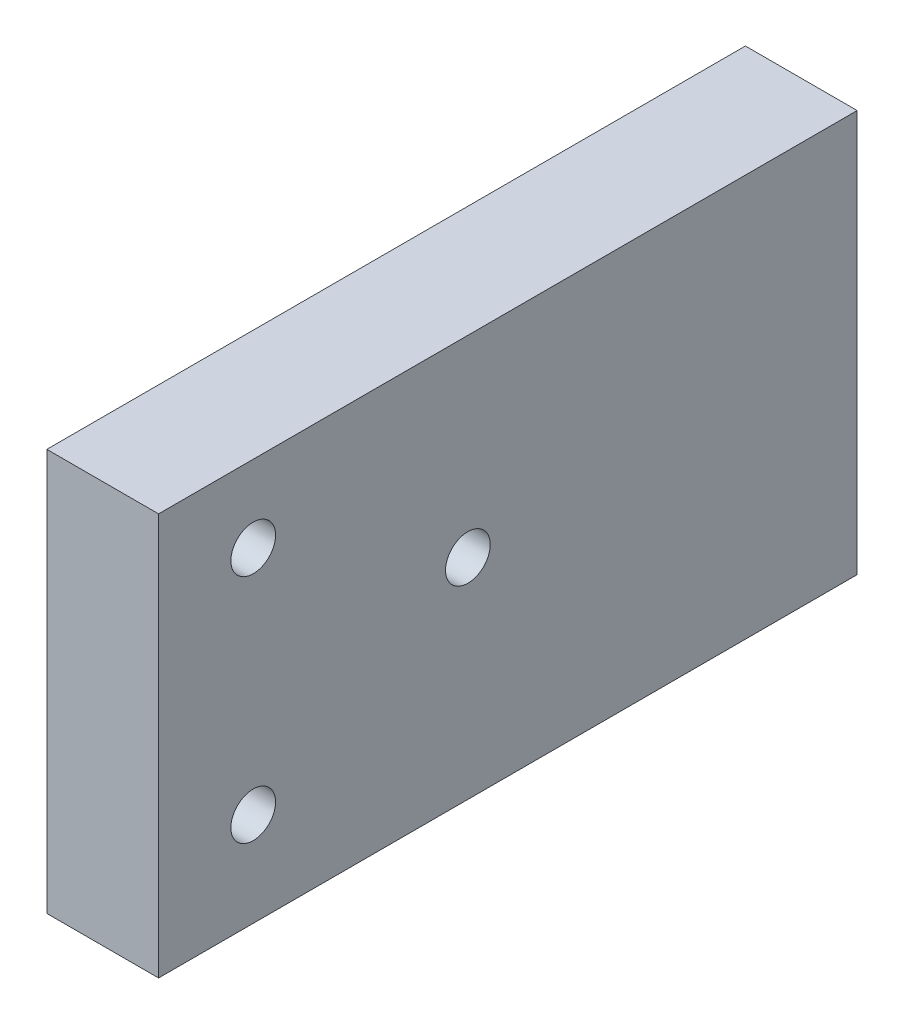
ISO-10303-21;
HEADER;
FILE_DESCRIPTION(('STEP AP214'),'2;1');
FILE_NAME('part.step','',(''),(''),'','','');
FILE_SCHEMA(('AUTOMOTIVE_DESIGN { 1 0 10303 214 1 1 1 1 }'));
ENDSEC;
DATA;
#1=APPLICATION_CONTEXT('core data for automotive mechanical design processes');
#2=APPLICATION_PROTOCOL_DEFINITION('international standard','automotive_design',2000,#1);
#3=PRODUCT_CONTEXT('',#1,'mechanical');
#4=PRODUCT('Part','Part','',(#3));
#5=PRODUCT_RELATED_PRODUCT_CATEGORY('part','',(#4));
#6=PRODUCT_DEFINITION_FORMATION('','',#4);
#7=PRODUCT_DEFINITION_CONTEXT('part definition',#1,'design');
#8=PRODUCT_DEFINITION('design','',#6,#7);
#9=PRODUCT_DEFINITION_SHAPE('','',#8);
#10=(LENGTH_UNIT() NAMED_UNIT(*) SI_UNIT(.MILLI.,.METRE.));
#11=(NAMED_UNIT(*) PLANE_ANGLE_UNIT() SI_UNIT($,.RADIAN.));
#12=(NAMED_UNIT(*) SI_UNIT($,.STERADIAN.) SOLID_ANGLE_UNIT());
#13=UNCERTAINTY_MEASURE_WITH_UNIT(LENGTH_MEASURE(1.E-05),#10,'distance_accuracy_value','');
#14=(GEOMETRIC_REPRESENTATION_CONTEXT(3) GLOBAL_UNCERTAINTY_ASSIGNED_CONTEXT((#13)) GLOBAL_UNIT_ASSIGNED_CONTEXT((#10,
#11,#12)) REPRESENTATION_CONTEXT('',''));
#15=CARTESIAN_POINT('',(0.,0.,0.));
#16=DIRECTION('',(0.,0.,1.));
#17=DIRECTION('',(1.,0.,0.));
#18=AXIS2_PLACEMENT_3D('',#15,#16,#17);
#19=CARTESIAN_POINT('',(94.,-5.00000000000009,50.));
#20=DIRECTION('',(-1.,0.,0.));
#21=DIRECTION('',(0.,0.,1.));
#22=AXIS2_PLACEMENT_3D('',#19,#20,#21);
#23=PLANE('',#22);
#24=CARTESIAN_POINT('',(94.,1.72922793707467,43.2270467736621));
#25=DIRECTION('',(-1.,0.,0.));
#26=DIRECTION('',(0.,0.,1.));
#27=AXIS2_PLACEMENT_3D('',#24,#25,#26);
#28=CIRCLE('',#27,1.6);
#29=CARTESIAN_POINT('',(94.,1.72922793707467,44.8270467736621));
#30=VERTEX_POINT('',#29);
#31=EDGE_CURVE('E127',#30,#30,#28,.T.);
#32=ORIENTED_EDGE('',*,*,#31,.T.);
#33=EDGE_LOOP('',(#32));
#34=FACE_BOUND('',#33,.T.);
#35=CARTESIAN_POINT('',(94.,9.99999999999993,27.8635233868311));
#36=DIRECTION('',(-1.,0.,0.));
#37=DIRECTION('',(0.,0.,1.));
#38=AXIS2_PLACEMENT_3D('',#35,#36,#37);
#39=CIRCLE('',#38,1.6);
#40=CARTESIAN_POINT('',(94.,9.99999999999993,29.4635233868311));
#41=VERTEX_POINT('',#40);
#42=EDGE_CURVE('E121',#41,#41,#39,.T.);
#43=ORIENTED_EDGE('',*,*,#42,.T.);
#44=EDGE_LOOP('',(#43));
#45=FACE_BOUND('',#44,.T.);
#46=CARTESIAN_POINT('',(94.,18.2707720629251,43.2270467736621));
#47=DIRECTION('',(-1.,0.,0.));
#48=DIRECTION('',(0.,0.,1.));
#49=AXIS2_PLACEMENT_3D('',#46,#47,#48);
#50=CIRCLE('',#49,1.6);
#51=CARTESIAN_POINT('',(94.,18.2707720629251,44.8270467736621));
#52=VERTEX_POINT('',#51);
#53=EDGE_CURVE('E114',#52,#52,#50,.T.);
#54=ORIENTED_EDGE('',*,*,#53,.T.);
#55=EDGE_LOOP('',(#54));
#56=FACE_BOUND('',#55,.T.);
#57=DIRECTION('',(0.,1.,0.));
#58=VECTOR('',#57,1.);
#59=CARTESIAN_POINT('',(94.,-5.00000000000009,0.));
#60=LINE('',#59,#58);
#61=CARTESIAN_POINT('',(94.,-5.00000000000009,0.));
#62=VERTEX_POINT('',#61);
#63=CARTESIAN_POINT('',(94.,23.7684537882721,0.));
#64=VERTEX_POINT('',#63);
#65=EDGE_CURVE('E100',#62,#64,#60,.T.);
#66=ORIENTED_EDGE('',*,*,#65,.T.);
#67=DIRECTION('',(0.,0.,-1.));
#68=VECTOR('',#67,1.);
#69=CARTESIAN_POINT('',(94.,23.7684537882721,50.));
#70=LINE('',#69,#68);
#71=CARTESIAN_POINT('',(94.,23.7684537882721,50.));
#72=VERTEX_POINT('',#71);
#73=EDGE_CURVE('E11',#72,#64,#70,.T.);
#74=ORIENTED_EDGE('',*,*,#73,.F.);
#75=DIRECTION('',(0.,1.,0.));
#76=VECTOR('',#75,1.);
#77=CARTESIAN_POINT('',(94.,-5.00000000000009,50.));
#78=LINE('',#77,#76);
#79=CARTESIAN_POINT('',(94.,-5.00000000000009,50.));
#80=VERTEX_POINT('',#79);
#81=EDGE_CURVE('E88',#80,#72,#78,.T.);
#82=ORIENTED_EDGE('',*,*,#81,.F.);
#83=DIRECTION('',(0.,0.,-1.));
#84=VECTOR('',#83,1.);
#85=CARTESIAN_POINT('',(94.,-5.00000000000009,50.));
#86=LINE('',#85,#84);
#87=EDGE_CURVE('E96',#80,#62,#86,.T.);
#88=ORIENTED_EDGE('',*,*,#87,.T.);
#89=EDGE_LOOP('',(#66,#74,#82,#88));
#90=FACE_BOUND('',#89,.T.);
#91=ADVANCED_FACE('F37',(#34,#45,#56,#90),#23,.F.);
#92=CARTESIAN_POINT('',(94.,23.7684537882721,50.));
#93=DIRECTION('',(0.,-1.,0.));
#94=DIRECTION('',(1.,0.,0.));
#95=AXIS2_PLACEMENT_3D('',#92,#93,#94);
#96=PLANE('',#95);
#97=DIRECTION('',(-1.,0.,0.));
#98=VECTOR('',#97,1.);
#99=CARTESIAN_POINT('',(94.,23.7684537882721,0.));
#100=LINE('',#99,#98);
#101=CARTESIAN_POINT('',(86.,23.7684537882721,0.));
#102=VERTEX_POINT('',#101);
#103=EDGE_CURVE('E92',#64,#102,#100,.T.);
#104=ORIENTED_EDGE('',*,*,#103,.T.);
#105=DIRECTION('',(0.,0.,-1.));
#106=VECTOR('',#105,1.);
#107=CARTESIAN_POINT('',(86.,23.7684537882721,50.));
#108=LINE('',#107,#106);
#109=CARTESIAN_POINT('',(86.,23.7684537882721,50.));
#110=VERTEX_POINT('',#109);
#111=EDGE_CURVE('E45',#110,#102,#108,.T.);
#112=ORIENTED_EDGE('',*,*,#111,.F.);
#113=DIRECTION('',(-1.,0.,0.));
#114=VECTOR('',#113,1.);
#115=CARTESIAN_POINT('',(94.,23.7684537882721,50.));
#116=LINE('',#115,#114);
#117=EDGE_CURVE('E83',#72,#110,#116,.T.);
#118=ORIENTED_EDGE('',*,*,#117,.F.);
#119=ORIENTED_EDGE('',*,*,#73,.T.);
#120=EDGE_LOOP('',(#104,#112,#118,#119));
#121=FACE_BOUND('',#120,.T.);
#122=ADVANCED_FACE('F91',(#121),#96,.F.);
#123=CARTESIAN_POINT('',(86.,-5.00000000000009,50.));
#124=DIRECTION('',(1.,0.,0.));
#125=DIRECTION('',(0.,0.,-1.));
#126=AXIS2_PLACEMENT_3D('',#123,#124,#125);
#127=PLANE('',#126);
#128=CARTESIAN_POINT('',(86.,1.72922793707467,43.2270467736621));
#129=DIRECTION('',(1.,0.,0.));
#130=DIRECTION('',(0.,0.,-1.));
#131=AXIS2_PLACEMENT_3D('',#128,#129,#130);
#132=CIRCLE('',#131,1.6);
#133=CARTESIAN_POINT('',(86.,1.72922793707467,41.6270467736621));
#134=VERTEX_POINT('',#133);
#135=EDGE_CURVE('E103',#134,#134,#132,.T.);
#136=ORIENTED_EDGE('',*,*,#135,.T.);
#137=EDGE_LOOP('',(#136));
#138=FACE_BOUND('',#137,.T.);
#139=CARTESIAN_POINT('',(86.,9.99999999999993,27.8635233868311));
#140=DIRECTION('',(1.,0.,0.));
#141=DIRECTION('',(0.,0.,-1.));
#142=AXIS2_PLACEMENT_3D('',#139,#140,#141);
#143=CIRCLE('',#142,1.6);
#144=CARTESIAN_POINT('',(86.,9.99999999999993,26.2635233868311));
#145=VERTEX_POINT('',#144);
#146=EDGE_CURVE('E124',#145,#145,#143,.T.);
#147=ORIENTED_EDGE('',*,*,#146,.T.);
#148=EDGE_LOOP('',(#147));
#149=FACE_BOUND('',#148,.T.);
#150=CARTESIAN_POINT('',(86.,18.2707720629251,43.2270467736621));
#151=DIRECTION('',(1.,0.,0.));
#152=DIRECTION('',(0.,0.,-1.));
#153=AXIS2_PLACEMENT_3D('',#150,#151,#152);
#154=CIRCLE('',#153,1.6);
#155=CARTESIAN_POINT('',(86.,18.2707720629251,41.6270467736621));
#156=VERTEX_POINT('',#155);
#157=EDGE_CURVE('E117',#156,#156,#154,.T.);
#158=ORIENTED_EDGE('',*,*,#157,.T.);
#159=EDGE_LOOP('',(#158));
#160=FACE_BOUND('',#159,.T.);
#161=DIRECTION('',(0.,-1.,0.));
#162=VECTOR('',#161,1.);
#163=CARTESIAN_POINT('',(86.,-5.00000000000009,0.));
#164=LINE('',#163,#162);
#165=CARTESIAN_POINT('',(86.,-5.00000000000009,0.));
#166=VERTEX_POINT('',#165);
#167=EDGE_CURVE('E70',#102,#166,#164,.T.);
#168=ORIENTED_EDGE('',*,*,#167,.T.);
#169=DIRECTION('',(0.,0.,-1.));
#170=VECTOR('',#169,1.);
#171=CARTESIAN_POINT('',(86.,-5.00000000000009,50.));
#172=LINE('',#171,#170);
#173=CARTESIAN_POINT('',(86.,-5.00000000000009,50.));
#174=VERTEX_POINT('',#173);
#175=EDGE_CURVE('E93',#174,#166,#172,.T.);
#176=ORIENTED_EDGE('',*,*,#175,.F.);
#177=DIRECTION('',(0.,-1.,0.));
#178=VECTOR('',#177,1.);
#179=CARTESIAN_POINT('',(86.,-5.00000000000009,50.));
#180=LINE('',#179,#178);
#181=EDGE_CURVE('E86',#110,#174,#180,.T.);
#182=ORIENTED_EDGE('',*,*,#181,.F.);
#183=ORIENTED_EDGE('',*,*,#111,.T.);
#184=EDGE_LOOP('',(#168,#176,#182,#183));
#185=FACE_BOUND('',#184,.T.);
#186=ADVANCED_FACE('F94',(#138,#149,#160,#185),#127,.F.);
#187=CARTESIAN_POINT('',(94.,-5.00000000000009,50.));
#188=DIRECTION('',(0.,1.,0.));
#189=DIRECTION('',(-1.,0.,0.));
#190=AXIS2_PLACEMENT_3D('',#187,#188,#189);
#191=PLANE('',#190);
#192=DIRECTION('',(1.,0.,0.));
#193=VECTOR('',#192,1.);
#194=CARTESIAN_POINT('',(94.,-5.00000000000009,0.));
#195=LINE('',#194,#193);
#196=EDGE_CURVE('E76',#166,#62,#195,.T.);
#197=ORIENTED_EDGE('',*,*,#196,.T.);
#198=ORIENTED_EDGE('',*,*,#87,.F.);
#199=DIRECTION('',(1.,0.,0.));
#200=VECTOR('',#199,1.);
#201=CARTESIAN_POINT('',(94.,-5.00000000000009,50.));
#202=LINE('',#201,#200);
#203=EDGE_CURVE('E53',#174,#80,#202,.T.);
#204=ORIENTED_EDGE('',*,*,#203,.F.);
#205=ORIENTED_EDGE('',*,*,#175,.T.);
#206=EDGE_LOOP('',(#197,#198,#204,#205));
#207=FACE_BOUND('',#206,.T.);
#208=ADVANCED_FACE('F108',(#207),#191,.F.);
#209=CARTESIAN_POINT('',(0.,0.,50.));
#210=DIRECTION('',(0.,0.,1.));
#211=DIRECTION('',(1.,0.,0.));
#212=AXIS2_PLACEMENT_3D('',#209,#210,#211);
#213=PLANE('',#212);
#214=ORIENTED_EDGE('',*,*,#81,.T.);
#215=ORIENTED_EDGE('',*,*,#117,.T.);
#216=ORIENTED_EDGE('',*,*,#181,.T.);
#217=ORIENTED_EDGE('',*,*,#203,.T.);
#218=EDGE_LOOP('',(#214,#215,#216,#217));
#219=FACE_BOUND('',#218,.T.);
#220=ADVANCED_FACE('F84',(#219),#213,.T.);
#221=CARTESIAN_POINT('',(0.,0.,0.));
#222=DIRECTION('',(0.,0.,1.));
#223=DIRECTION('',(1.,0.,0.));
#224=AXIS2_PLACEMENT_3D('',#221,#222,#223);
#225=PLANE('',#224);
#226=CARTESIAN_POINT('',(90.0735772361907,0.999999999999912,0.));
#227=DIRECTION('',(0.,0.,-1.));
#228=DIRECTION('',(-1.,0.,0.));
#229=AXIS2_PLACEMENT_3D('',#226,#227,#228);
#230=CIRCLE('',#229,1.95);
#231=CARTESIAN_POINT('',(88.1235772361907,0.999999999999912,0.));
#232=VERTEX_POINT('',#231);
#233=EDGE_CURVE('E144',#232,#232,#230,.T.);
#234=ORIENTED_EDGE('',*,*,#233,.F.);
#235=EDGE_LOOP('',(#234));
#236=FACE_BOUND('',#235,.T.);
#237=CARTESIAN_POINT('',(90.,9.38422689413605,0.));
#238=DIRECTION('',(0.,0.,-1.));
#239=DIRECTION('',(-1.,0.,0.));
#240=AXIS2_PLACEMENT_3D('',#237,#238,#239);
#241=CIRCLE('',#240,1.95);
#242=CARTESIAN_POINT('',(88.05,9.38422689413605,0.));
#243=VERTEX_POINT('',#242);
#244=EDGE_CURVE('E138',#243,#243,#241,.T.);
#245=ORIENTED_EDGE('',*,*,#244,.F.);
#246=EDGE_LOOP('',(#245));
#247=FACE_BOUND('',#246,.T.);
#248=CARTESIAN_POINT('',(90.,17.7684537882721,0.));
#249=DIRECTION('',(0.,0.,-1.));
#250=DIRECTION('',(-1.,0.,0.));
#251=AXIS2_PLACEMENT_3D('',#248,#249,#250);
#252=CIRCLE('',#251,1.95);
#253=CARTESIAN_POINT('',(88.05,17.7684537882721,0.));
#254=VERTEX_POINT('',#253);
#255=EDGE_CURVE('E132',#254,#254,#252,.T.);
#256=ORIENTED_EDGE('',*,*,#255,.F.);
#257=EDGE_LOOP('',(#256));
#258=FACE_BOUND('',#257,.T.);
#259=ORIENTED_EDGE('',*,*,#65,.F.);
#260=ORIENTED_EDGE('',*,*,#196,.F.);
#261=ORIENTED_EDGE('',*,*,#167,.F.);
#262=ORIENTED_EDGE('',*,*,#103,.F.);
#263=EDGE_LOOP('',(#259,#260,#261,#262));
#264=FACE_BOUND('',#263,.T.);
#265=ADVANCED_FACE('F111',(#236,#247,#258,#264),#225,.F.);
#266=CARTESIAN_POINT('',(94.001,18.2707720629251,43.2270467736621));
#267=DIRECTION('',(-1.,0.,0.));
#268=DIRECTION('',(0.,0.,1.));
#269=AXIS2_PLACEMENT_3D('',#266,#267,#268);
#270=CYLINDRICAL_SURFACE('',#269,1.6);
#271=ORIENTED_EDGE('',*,*,#157,.F.);
#272=EDGE_LOOP('',(#271));
#273=FACE_BOUND('',#272,.T.);
#274=ORIENTED_EDGE('',*,*,#53,.F.);
#275=EDGE_LOOP('',(#274));
#276=FACE_BOUND('',#275,.T.);
#277=ADVANCED_FACE('F161',(#273,#276),#270,.F.);
#278=CARTESIAN_POINT('',(94.001,9.99999999999993,27.8635233868311));
#279=DIRECTION('',(-1.,0.,0.));
#280=DIRECTION('',(0.,0.,1.));
#281=AXIS2_PLACEMENT_3D('',#278,#279,#280);
#282=CYLINDRICAL_SURFACE('',#281,1.6);
#283=ORIENTED_EDGE('',*,*,#146,.F.);
#284=EDGE_LOOP('',(#283));
#285=FACE_BOUND('',#284,.T.);
#286=ORIENTED_EDGE('',*,*,#42,.F.);
#287=EDGE_LOOP('',(#286));
#288=FACE_BOUND('',#287,.T.);
#289=ADVANCED_FACE('F180',(#285,#288),#282,.F.);
#290=CARTESIAN_POINT('',(94.001,1.72922793707467,43.2270467736621));
#291=DIRECTION('',(-1.,0.,0.));
#292=DIRECTION('',(0.,0.,1.));
#293=AXIS2_PLACEMENT_3D('',#290,#291,#292);
#294=CYLINDRICAL_SURFACE('',#293,1.6);
#295=ORIENTED_EDGE('',*,*,#135,.F.);
#296=EDGE_LOOP('',(#295));
#297=FACE_BOUND('',#296,.T.);
#298=ORIENTED_EDGE('',*,*,#31,.F.);
#299=EDGE_LOOP('',(#298));
#300=FACE_BOUND('',#299,.T.);
#301=ADVANCED_FACE('F170',(#297,#300),#294,.F.);
#302=CARTESIAN_POINT('',(90.,17.7684537882721,22.));
#303=DIRECTION('',(0.,0.,-1.));
#304=DIRECTION('',(-1.,0.,0.));
#305=AXIS2_PLACEMENT_3D('',#302,#303,#304);
#306=CYLINDRICAL_SURFACE('',#305,1.95);
#307=CARTESIAN_POINT('',(90.,17.7684537882721,22.));
#308=DIRECTION('',(0.,0.,-1.));
#309=DIRECTION('',(-1.,0.,0.));
#310=AXIS2_PLACEMENT_3D('',#307,#308,#309);
#311=CIRCLE('',#310,1.95);
#312=CARTESIAN_POINT('',(88.05,17.7684537882721,22.));
#313=VERTEX_POINT('',#312);
#314=EDGE_CURVE('E135',#313,#313,#311,.T.);
#315=ORIENTED_EDGE('',*,*,#314,.F.);
#316=EDGE_LOOP('',(#315));
#317=FACE_BOUND('',#316,.T.);
#318=ORIENTED_EDGE('',*,*,#255,.T.);
#319=EDGE_LOOP('',(#318));
#320=FACE_BOUND('',#319,.T.);
#321=ADVANCED_FACE('F167',(#317,#320),#306,.F.);
#322=CARTESIAN_POINT('',(90.,17.7684537882721,22.));
#323=DIRECTION('',(0.,0.,-1.));
#324=DIRECTION('',(-1.,0.,0.));
#325=AXIS2_PLACEMENT_3D('',#322,#323,#324);
#326=PLANE('',#325);
#327=ORIENTED_EDGE('',*,*,#314,.T.);
#328=EDGE_LOOP('',(#327));
#329=FACE_BOUND('',#328,.T.);
#330=ADVANCED_FACE('F169',(#329),#326,.T.);
#331=CARTESIAN_POINT('',(90.,9.38422689413605,22.));
#332=DIRECTION('',(0.,0.,-1.));
#333=DIRECTION('',(-1.,0.,0.));
#334=AXIS2_PLACEMENT_3D('',#331,#332,#333);
#335=CYLINDRICAL_SURFACE('',#334,1.95);
#336=CARTESIAN_POINT('',(90.,9.38422689413605,22.));
#337=DIRECTION('',(0.,0.,-1.));
#338=DIRECTION('',(-1.,0.,0.));
#339=AXIS2_PLACEMENT_3D('',#336,#337,#338);
#340=CIRCLE('',#339,1.95);
#341=CARTESIAN_POINT('',(88.05,9.38422689413605,22.));
#342=VERTEX_POINT('',#341);
#343=EDGE_CURVE('E141',#342,#342,#340,.T.);
#344=ORIENTED_EDGE('',*,*,#343,.F.);
#345=EDGE_LOOP('',(#344));
#346=FACE_BOUND('',#345,.T.);
#347=ORIENTED_EDGE('',*,*,#244,.T.);
#348=EDGE_LOOP('',(#347));
#349=FACE_BOUND('',#348,.T.);
#350=ADVANCED_FACE('F177',(#346,#349),#335,.F.);
#351=CARTESIAN_POINT('',(90.,9.38422689413605,22.));
#352=DIRECTION('',(0.,0.,-1.));
#353=DIRECTION('',(-1.,0.,0.));
#354=AXIS2_PLACEMENT_3D('',#351,#352,#353);
#355=PLANE('',#354);
#356=ORIENTED_EDGE('',*,*,#343,.T.);
#357=EDGE_LOOP('',(#356));
#358=FACE_BOUND('',#357,.T.);
#359=ADVANCED_FACE('F155',(#358),#355,.T.);
#360=CARTESIAN_POINT('',(90.0735772361907,0.999999999999912,22.));
#361=DIRECTION('',(0.,0.,-1.));
#362=DIRECTION('',(-1.,0.,0.));
#363=AXIS2_PLACEMENT_3D('',#360,#361,#362);
#364=CYLINDRICAL_SURFACE('',#363,1.95);
#365=CARTESIAN_POINT('',(90.0735772361907,0.999999999999912,22.));
#366=DIRECTION('',(0.,0.,-1.));
#367=DIRECTION('',(-1.,0.,0.));
#368=AXIS2_PLACEMENT_3D('',#365,#366,#367);
#369=CIRCLE('',#368,1.95);
#370=CARTESIAN_POINT('',(88.1235772361907,0.999999999999912,22.));
#371=VERTEX_POINT('',#370);
#372=EDGE_CURVE('E118',#371,#371,#369,.T.);
#373=ORIENTED_EDGE('',*,*,#372,.F.);
#374=EDGE_LOOP('',(#373));
#375=FACE_BOUND('',#374,.T.);
#376=ORIENTED_EDGE('',*,*,#233,.T.);
#377=EDGE_LOOP('',(#376));
#378=FACE_BOUND('',#377,.T.);
#379=ADVANCED_FACE('F152',(#375,#378),#364,.F.);
#380=CARTESIAN_POINT('',(90.0735772361907,0.999999999999912,22.));
#381=DIRECTION('',(0.,0.,-1.));
#382=DIRECTION('',(-1.,0.,0.));
#383=AXIS2_PLACEMENT_3D('',#380,#381,#382);
#384=PLANE('',#383);
#385=ORIENTED_EDGE('',*,*,#372,.T.);
#386=EDGE_LOOP('',(#385));
#387=FACE_BOUND('',#386,.T.);
#388=ADVANCED_FACE('F150',(#387),#384,.T.);
#389=CLOSED_SHELL('',(#91,#122,#186,#208,#220,#265,#277,#289,#301,#321,#330,#350,#359,#379,#388));
#390=MANIFOLD_SOLID_BREP('B2',#389);
#391=ADVANCED_BREP_SHAPE_REPRESENTATION('',(#18,#390),#14);
#392=SHAPE_DEFINITION_REPRESENTATION(#9,#391);
ENDSEC;
END-ISO-10303-21;
